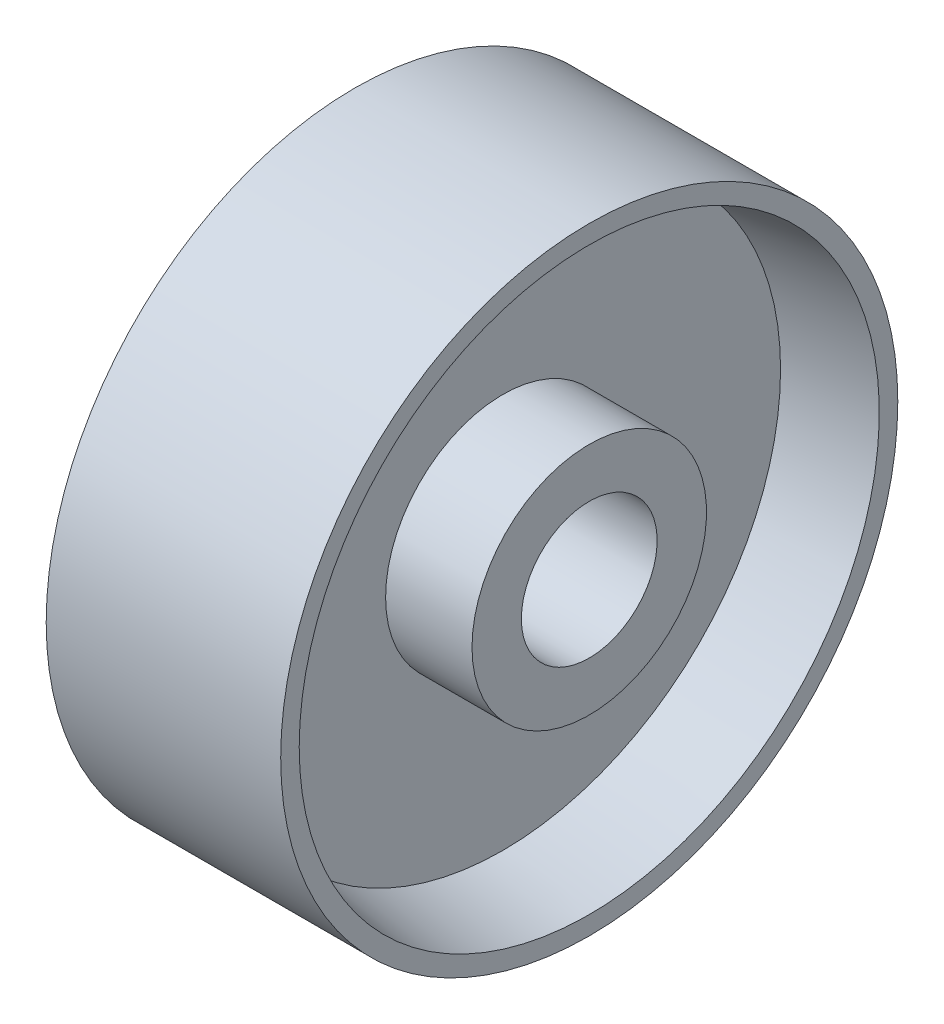
ISO-10303-21;
HEADER;
FILE_DESCRIPTION(('STEP AP214'),'2;1');
FILE_NAME('part.step','',(''),(''),'','','');
FILE_SCHEMA(('AUTOMOTIVE_DESIGN { 1 0 10303 214 1 1 1 1 }'));
ENDSEC;
DATA;
#1=APPLICATION_CONTEXT('core data for automotive mechanical design processes');
#2=APPLICATION_PROTOCOL_DEFINITION('international standard','automotive_design',2000,#1);
#3=PRODUCT_CONTEXT('',#1,'mechanical');
#4=PRODUCT('Part','Part','',(#3));
#5=PRODUCT_RELATED_PRODUCT_CATEGORY('part','',(#4));
#6=PRODUCT_DEFINITION_FORMATION('','',#4);
#7=PRODUCT_DEFINITION_CONTEXT('part definition',#1,'design');
#8=PRODUCT_DEFINITION('design','',#6,#7);
#9=PRODUCT_DEFINITION_SHAPE('','',#8);
#10=(LENGTH_UNIT() NAMED_UNIT(*) SI_UNIT(.MILLI.,.METRE.));
#11=(NAMED_UNIT(*) PLANE_ANGLE_UNIT() SI_UNIT($,.RADIAN.));
#12=(NAMED_UNIT(*) SI_UNIT($,.STERADIAN.) SOLID_ANGLE_UNIT());
#13=UNCERTAINTY_MEASURE_WITH_UNIT(LENGTH_MEASURE(1.E-05),#10,'distance_accuracy_value','');
#14=(GEOMETRIC_REPRESENTATION_CONTEXT(3) GLOBAL_UNCERTAINTY_ASSIGNED_CONTEXT((#13)) GLOBAL_UNIT_ASSIGNED_CONTEXT((#10,
#11,#12)) REPRESENTATION_CONTEXT('',''));
#15=CARTESIAN_POINT('',(0.,0.,0.));
#16=DIRECTION('',(0.,0.,1.));
#17=DIRECTION('',(1.,0.,0.));
#18=AXIS2_PLACEMENT_3D('',#15,#16,#17);
#19=CARTESIAN_POINT('',(19.,19.,0.));
#20=DIRECTION('',(-1.,0.,0.));
#21=DIRECTION('',(0.,0.,1.));
#22=AXIS2_PLACEMENT_3D('',#19,#20,#21);
#23=PLANE('',#22);
#24=CARTESIAN_POINT('',(19.,0.,0.));
#25=DIRECTION('',(-1.,0.,0.));
#26=DIRECTION('',(0.,0.,1.));
#27=AXIS2_PLACEMENT_3D('',#24,#25,#26);
#28=CIRCLE('',#27,19.);
#29=CARTESIAN_POINT('',(19.,0.,19.));
#30=VERTEX_POINT('',#29);
#31=EDGE_CURVE('E88',#30,#30,#28,.T.);
#32=ORIENTED_EDGE('',*,*,#31,.F.);
#33=EDGE_LOOP('',(#32));
#34=FACE_BOUND('',#33,.T.);
#35=CARTESIAN_POINT('',(19.,0.,0.));
#36=DIRECTION('',(-1.,0.,0.));
#37=DIRECTION('',(0.,0.,1.));
#38=AXIS2_PLACEMENT_3D('',#35,#36,#37);
#39=CIRCLE('',#38,11.);
#40=CARTESIAN_POINT('',(19.,0.,11.));
#41=VERTEX_POINT('',#40);
#42=EDGE_CURVE('E10',#41,#41,#39,.T.);
#43=ORIENTED_EDGE('',*,*,#42,.T.);
#44=EDGE_LOOP('',(#43));
#45=FACE_BOUND('',#44,.T.);
#46=ADVANCED_FACE('F37',(#34,#45),#23,.F.);
#47=CARTESIAN_POINT('',(-14.7612903225807,0.,0.));
#48=DIRECTION('',(-1.,0.,0.));
#49=DIRECTION('',(0.,0.,1.));
#50=AXIS2_PLACEMENT_3D('',#47,#48,#49);
#51=CYLINDRICAL_SURFACE('',#50,11.);
#52=ORIENTED_EDGE('',*,*,#42,.F.);
#53=EDGE_LOOP('',(#52));
#54=FACE_BOUND('',#53,.T.);
#55=CARTESIAN_POINT('',(-19.,0.,0.));
#56=DIRECTION('',(-1.,0.,0.));
#57=DIRECTION('',(0.,0.,1.));
#58=AXIS2_PLACEMENT_3D('',#55,#56,#57);
#59=CIRCLE('',#58,11.);
#60=CARTESIAN_POINT('',(-19.,0.,11.));
#61=VERTEX_POINT('',#60);
#62=EDGE_CURVE('E44',#61,#61,#59,.T.);
#63=ORIENTED_EDGE('',*,*,#62,.T.);
#64=EDGE_LOOP('',(#63));
#65=FACE_BOUND('',#64,.T.);
#66=ADVANCED_FACE('F96',(#54,#65),#51,.F.);
#67=CARTESIAN_POINT('',(-19.,11.,0.));
#68=DIRECTION('',(1.,0.,0.));
#69=DIRECTION('',(0.,0.,-1.));
#70=AXIS2_PLACEMENT_3D('',#67,#68,#69);
#71=PLANE('',#70);
#72=ORIENTED_EDGE('',*,*,#62,.F.);
#73=EDGE_LOOP('',(#72));
#74=FACE_BOUND('',#73,.T.);
#75=CARTESIAN_POINT('',(-19.,0.,0.));
#76=DIRECTION('',(-1.,0.,0.));
#77=DIRECTION('',(0.,0.,1.));
#78=AXIS2_PLACEMENT_3D('',#75,#76,#77);
#79=CIRCLE('',#78,19.);
#80=CARTESIAN_POINT('',(-19.,0.,19.));
#81=VERTEX_POINT('',#80);
#82=EDGE_CURVE('E49',#81,#81,#79,.T.);
#83=ORIENTED_EDGE('',*,*,#82,.T.);
#84=EDGE_LOOP('',(#83));
#85=FACE_BOUND('',#84,.T.);
#86=ADVANCED_FACE('F100',(#74,#85),#71,.F.);
#87=CARTESIAN_POINT('',(-14.7612903225807,0.,0.));
#88=DIRECTION('',(-1.,0.,0.));
#89=DIRECTION('',(0.,0.,1.));
#90=AXIS2_PLACEMENT_3D('',#87,#88,#89);
#91=CYLINDRICAL_SURFACE('',#90,19.);
#92=ORIENTED_EDGE('',*,*,#82,.F.);
#93=EDGE_LOOP('',(#92));
#94=FACE_BOUND('',#93,.T.);
#95=CARTESIAN_POINT('',(-5.,0.,0.));
#96=DIRECTION('',(-1.,0.,0.));
#97=DIRECTION('',(0.,0.,1.));
#98=AXIS2_PLACEMENT_3D('',#95,#96,#97);
#99=CIRCLE('',#98,19.);
#100=CARTESIAN_POINT('',(-5.,0.,19.));
#101=VERTEX_POINT('',#100);
#102=EDGE_CURVE('E54',#101,#101,#99,.T.);
#103=ORIENTED_EDGE('',*,*,#102,.T.);
#104=EDGE_LOOP('',(#103));
#105=FACE_BOUND('',#104,.T.);
#106=ADVANCED_FACE('F105',(#94,#105),#91,.T.);
#107=CARTESIAN_POINT('',(-5.,19.,0.));
#108=DIRECTION('',(1.,0.,0.));
#109=DIRECTION('',(0.,0.,-1.));
#110=AXIS2_PLACEMENT_3D('',#107,#108,#109);
#111=PLANE('',#110);
#112=ORIENTED_EDGE('',*,*,#102,.F.);
#113=EDGE_LOOP('',(#112));
#114=FACE_BOUND('',#113,.T.);
#115=CARTESIAN_POINT('',(-5.,0.,0.));
#116=DIRECTION('',(-1.,0.,0.));
#117=DIRECTION('',(0.,0.,1.));
#118=AXIS2_PLACEMENT_3D('',#115,#116,#117);
#119=CIRCLE('',#118,45.);
#120=CARTESIAN_POINT('',(-5.,0.,45.));
#121=VERTEX_POINT('',#120);
#122=EDGE_CURVE('E60',#121,#121,#119,.T.);
#123=ORIENTED_EDGE('',*,*,#122,.T.);
#124=EDGE_LOOP('',(#123));
#125=FACE_BOUND('',#124,.T.);
#126=ADVANCED_FACE('F111',(#114,#125),#111,.F.);
#127=CARTESIAN_POINT('',(-19.,0.,0.));
#128=DIRECTION('',(-1.,0.,0.));
#129=DIRECTION('',(0.,0.,1.));
#130=AXIS2_PLACEMENT_3D('',#127,#128,#129);
#131=CONICAL_SURFACE('',#130,47.,0.141897054604164);
#132=ORIENTED_EDGE('',*,*,#122,.F.);
#133=EDGE_LOOP('',(#132));
#134=FACE_BOUND('',#133,.T.);
#135=CARTESIAN_POINT('',(-19.,0.,0.));
#136=DIRECTION('',(-1.,0.,0.));
#137=DIRECTION('',(0.,0.,1.));
#138=AXIS2_PLACEMENT_3D('',#135,#136,#137);
#139=CIRCLE('',#138,47.);
#140=CARTESIAN_POINT('',(-19.,0.,47.));
#141=VERTEX_POINT('',#140);
#142=EDGE_CURVE('E64',#141,#141,#139,.T.);
#143=ORIENTED_EDGE('',*,*,#142,.T.);
#144=EDGE_LOOP('',(#143));
#145=FACE_BOUND('',#144,.T.);
#146=ADVANCED_FACE('F115',(#134,#145),#131,.F.);
#147=CARTESIAN_POINT('',(-19.,47.,0.));
#148=DIRECTION('',(1.,0.,0.));
#149=DIRECTION('',(0.,0.,-1.));
#150=AXIS2_PLACEMENT_3D('',#147,#148,#149);
#151=PLANE('',#150);
#152=ORIENTED_EDGE('',*,*,#142,.F.);
#153=EDGE_LOOP('',(#152));
#154=FACE_BOUND('',#153,.T.);
#155=CARTESIAN_POINT('',(-19.,0.,0.));
#156=DIRECTION('',(-1.,0.,0.));
#157=DIRECTION('',(0.,0.,1.));
#158=AXIS2_PLACEMENT_3D('',#155,#156,#157);
#159=CIRCLE('',#158,50.);
#160=CARTESIAN_POINT('',(-19.,0.,50.));
#161=VERTEX_POINT('',#160);
#162=EDGE_CURVE('E68',#161,#161,#159,.T.);
#163=ORIENTED_EDGE('',*,*,#162,.T.);
#164=EDGE_LOOP('',(#163));
#165=FACE_BOUND('',#164,.T.);
#166=ADVANCED_FACE('F119',(#154,#165),#151,.F.);
#167=CARTESIAN_POINT('',(-14.7612903225807,0.,0.));
#168=DIRECTION('',(-1.,0.,0.));
#169=DIRECTION('',(0.,0.,1.));
#170=AXIS2_PLACEMENT_3D('',#167,#168,#169);
#171=CYLINDRICAL_SURFACE('',#170,50.);
#172=ORIENTED_EDGE('',*,*,#162,.F.);
#173=EDGE_LOOP('',(#172));
#174=FACE_BOUND('',#173,.T.);
#175=CARTESIAN_POINT('',(19.,0.,0.));
#176=DIRECTION('',(-1.,0.,0.));
#177=DIRECTION('',(0.,0.,1.));
#178=AXIS2_PLACEMENT_3D('',#175,#176,#177);
#179=CIRCLE('',#178,50.);
#180=CARTESIAN_POINT('',(19.,0.,50.));
#181=VERTEX_POINT('',#180);
#182=EDGE_CURVE('E72',#181,#181,#179,.T.);
#183=ORIENTED_EDGE('',*,*,#182,.T.);
#184=EDGE_LOOP('',(#183));
#185=FACE_BOUND('',#184,.T.);
#186=ADVANCED_FACE('F123',(#174,#185),#171,.T.);
#187=CARTESIAN_POINT('',(19.,50.,0.));
#188=DIRECTION('',(-1.,0.,0.));
#189=DIRECTION('',(0.,0.,1.));
#190=AXIS2_PLACEMENT_3D('',#187,#188,#189);
#191=PLANE('',#190);
#192=ORIENTED_EDGE('',*,*,#182,.F.);
#193=EDGE_LOOP('',(#192));
#194=FACE_BOUND('',#193,.T.);
#195=CARTESIAN_POINT('',(19.,0.,0.));
#196=DIRECTION('',(-1.,0.,0.));
#197=DIRECTION('',(0.,0.,1.));
#198=AXIS2_PLACEMENT_3D('',#195,#196,#197);
#199=CIRCLE('',#198,47.);
#200=CARTESIAN_POINT('',(19.,0.,47.));
#201=VERTEX_POINT('',#200);
#202=EDGE_CURVE('E76',#201,#201,#199,.T.);
#203=ORIENTED_EDGE('',*,*,#202,.T.);
#204=EDGE_LOOP('',(#203));
#205=FACE_BOUND('',#204,.T.);
#206=ADVANCED_FACE('F127',(#194,#205),#191,.F.);
#207=CARTESIAN_POINT('',(5.,0.,0.));
#208=DIRECTION('',(1.,0.,0.));
#209=DIRECTION('',(0.,0.,-1.));
#210=AXIS2_PLACEMENT_3D('',#207,#208,#209);
#211=CONICAL_SURFACE('',#210,45.,0.141897054604164);
#212=ORIENTED_EDGE('',*,*,#202,.F.);
#213=EDGE_LOOP('',(#212));
#214=FACE_BOUND('',#213,.T.);
#215=CARTESIAN_POINT('',(5.,0.,0.));
#216=DIRECTION('',(-1.,0.,0.));
#217=DIRECTION('',(0.,0.,1.));
#218=AXIS2_PLACEMENT_3D('',#215,#216,#217);
#219=CIRCLE('',#218,45.);
#220=CARTESIAN_POINT('',(5.,0.,45.));
#221=VERTEX_POINT('',#220);
#222=EDGE_CURVE('E80',#221,#221,#219,.T.);
#223=ORIENTED_EDGE('',*,*,#222,.T.);
#224=EDGE_LOOP('',(#223));
#225=FACE_BOUND('',#224,.T.);
#226=ADVANCED_FACE('F131',(#214,#225),#211,.F.);
#227=CARTESIAN_POINT('',(5.,45.,0.));
#228=DIRECTION('',(-1.,0.,0.));
#229=DIRECTION('',(0.,0.,1.));
#230=AXIS2_PLACEMENT_3D('',#227,#228,#229);
#231=PLANE('',#230);
#232=ORIENTED_EDGE('',*,*,#222,.F.);
#233=EDGE_LOOP('',(#232));
#234=FACE_BOUND('',#233,.T.);
#235=CARTESIAN_POINT('',(5.,0.,0.));
#236=DIRECTION('',(-1.,0.,0.));
#237=DIRECTION('',(0.,0.,1.));
#238=AXIS2_PLACEMENT_3D('',#235,#236,#237);
#239=CIRCLE('',#238,19.);
#240=CARTESIAN_POINT('',(5.,0.,19.));
#241=VERTEX_POINT('',#240);
#242=EDGE_CURVE('E84',#241,#241,#239,.T.);
#243=ORIENTED_EDGE('',*,*,#242,.T.);
#244=EDGE_LOOP('',(#243));
#245=FACE_BOUND('',#244,.T.);
#246=ADVANCED_FACE('F135',(#234,#245),#231,.F.);
#247=CARTESIAN_POINT('',(-14.7612903225807,0.,0.));
#248=DIRECTION('',(-1.,0.,0.));
#249=DIRECTION('',(0.,0.,1.));
#250=AXIS2_PLACEMENT_3D('',#247,#248,#249);
#251=CYLINDRICAL_SURFACE('',#250,19.);
#252=ORIENTED_EDGE('',*,*,#242,.F.);
#253=EDGE_LOOP('',(#252));
#254=FACE_BOUND('',#253,.T.);
#255=ORIENTED_EDGE('',*,*,#31,.T.);
#256=EDGE_LOOP('',(#255));
#257=FACE_BOUND('',#256,.T.);
#258=ADVANCED_FACE('F93',(#254,#257),#251,.T.);
#259=CLOSED_SHELL('',(#46,#66,#86,#106,#126,#146,#166,#186,#206,#226,#246,#258));
#260=MANIFOLD_SOLID_BREP('B2',#259);
#261=ADVANCED_BREP_SHAPE_REPRESENTATION('',(#18,#260),#14);
#262=SHAPE_DEFINITION_REPRESENTATION(#9,#261);
ENDSEC;
END-ISO-10303-21;
